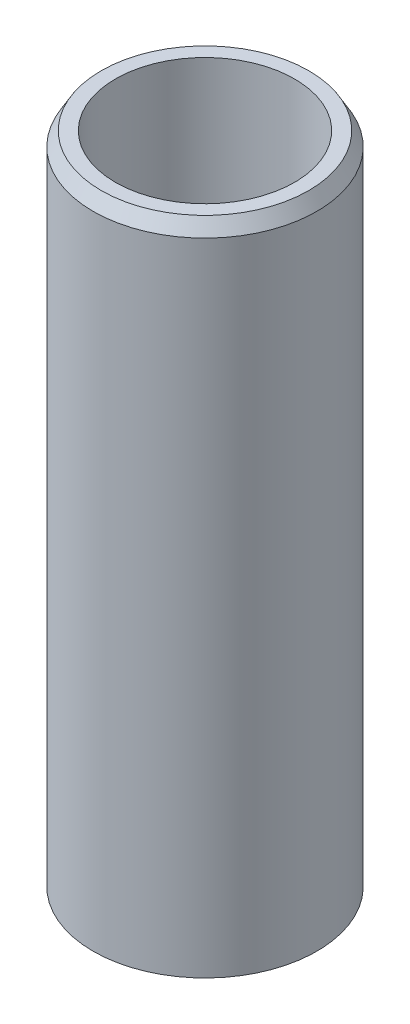
ISO-10303-21;
HEADER;
FILE_DESCRIPTION(('STEP AP214'),'2;1');
FILE_NAME('part.step','',(''),(''),'','','');
FILE_SCHEMA(('AUTOMOTIVE_DESIGN { 1 0 10303 214 1 1 1 1 }'));
ENDSEC;
DATA;
#1=APPLICATION_CONTEXT('core data for automotive mechanical design processes');
#2=APPLICATION_PROTOCOL_DEFINITION('international standard','automotive_design',2000,#1);
#3=PRODUCT_CONTEXT('',#1,'mechanical');
#4=PRODUCT('Part','Part','',(#3));
#5=PRODUCT_RELATED_PRODUCT_CATEGORY('part','',(#4));
#6=PRODUCT_DEFINITION_FORMATION('','',#4);
#7=PRODUCT_DEFINITION_CONTEXT('part definition',#1,'design');
#8=PRODUCT_DEFINITION('design','',#6,#7);
#9=PRODUCT_DEFINITION_SHAPE('','',#8);
#10=(LENGTH_UNIT() NAMED_UNIT(*) SI_UNIT(.MILLI.,.METRE.));
#11=(NAMED_UNIT(*) PLANE_ANGLE_UNIT() SI_UNIT($,.RADIAN.));
#12=(NAMED_UNIT(*) SI_UNIT($,.STERADIAN.) SOLID_ANGLE_UNIT());
#13=UNCERTAINTY_MEASURE_WITH_UNIT(LENGTH_MEASURE(1.E-05),#10,'distance_accuracy_value','');
#14=(GEOMETRIC_REPRESENTATION_CONTEXT(3) GLOBAL_UNCERTAINTY_ASSIGNED_CONTEXT((#13)) GLOBAL_UNIT_ASSIGNED_CONTEXT((#10,
#11,#12)) REPRESENTATION_CONTEXT('',''));
#15=CARTESIAN_POINT('',(0.,0.,0.));
#16=DIRECTION('',(0.,0.,1.));
#17=DIRECTION('',(1.,0.,0.));
#18=AXIS2_PLACEMENT_3D('',#15,#16,#17);
#19=CARTESIAN_POINT('',(0.,266.603887036019,0.));
#20=DIRECTION('',(0.,-1.,0.));
#21=DIRECTION('',(0.,0.,-1.));
#22=AXIS2_PLACEMENT_3D('',#19,#20,#21);
#23=CYLINDRICAL_SURFACE('',#22,45.);
#24=CARTESIAN_POINT('',(0.,260.974032538074,0.));
#25=DIRECTION('',(0.,1.,0.));
#26=DIRECTION('',(0.,0.,1.));
#27=AXIS2_PLACEMENT_3D('',#24,#25,#26);
#28=CIRCLE('',#27,45.);
#29=CARTESIAN_POINT('',(0.,260.974032538074,45.));
#30=VERTEX_POINT('',#29);
#31=EDGE_CURVE('E50',#30,#30,#28,.F.);
#32=ORIENTED_EDGE('',*,*,#31,.T.);
#33=EDGE_LOOP('',(#32));
#34=FACE_BOUND('',#33,.T.);
#35=CARTESIAN_POINT('',(0.,3.25039800988708,0.));
#36=DIRECTION('',(0.,1.,0.));
#37=DIRECTION('',(0.,0.,1.));
#38=AXIS2_PLACEMENT_3D('',#35,#36,#37);
#39=CIRCLE('',#38,45.);
#40=CARTESIAN_POINT('',(0.,3.25039800988708,45.));
#41=VERTEX_POINT('',#40);
#42=EDGE_CURVE('E51',#41,#41,#39,.T.);
#43=ORIENTED_EDGE('',*,*,#42,.T.);
#44=EDGE_LOOP('',(#43));
#45=FACE_BOUND('',#44,.T.);
#46=ADVANCED_FACE('F39',(#34,#45),#23,.T.);
#47=CARTESIAN_POINT('',(0.,266.603887036019,0.));
#48=DIRECTION('',(0.,1.,0.));
#49=DIRECTION('',(0.,0.,1.));
#50=AXIS2_PLACEMENT_3D('',#47,#48,#49);
#51=PLANE('',#50);
#52=CARTESIAN_POINT('',(0.,266.603887036019,0.));
#53=DIRECTION('',(0.,1.,0.));
#54=DIRECTION('',(0.,0.,1.));
#55=AXIS2_PLACEMENT_3D('',#52,#53,#54);
#56=CIRCLE('',#55,41.749601990113);
#57=CARTESIAN_POINT('',(0.,266.603887036019,41.749601990113));
#58=VERTEX_POINT('',#57);
#59=EDGE_CURVE('E54',#58,#58,#56,.T.);
#60=ORIENTED_EDGE('',*,*,#59,.T.);
#61=EDGE_LOOP('',(#60));
#62=FACE_BOUND('',#61,.T.);
#63=CARTESIAN_POINT('',(0.,266.603887036019,0.));
#64=DIRECTION('',(0.,1.,0.));
#65=DIRECTION('',(0.,0.,1.));
#66=AXIS2_PLACEMENT_3D('',#63,#64,#65);
#67=CIRCLE('',#66,36.0390984302873);
#68=CARTESIAN_POINT('',(0.,266.603887036019,36.0390984302873));
#69=VERTEX_POINT('',#68);
#70=EDGE_CURVE('E58',#69,#69,#67,.T.);
#71=ORIENTED_EDGE('',*,*,#70,.F.);
#72=EDGE_LOOP('',(#71));
#73=FACE_BOUND('',#72,.T.);
#74=ADVANCED_FACE('F69',(#62,#73),#51,.T.);
#75=CARTESIAN_POINT('',(0.,0.,0.));
#76=DIRECTION('',(0.,1.,0.));
#77=DIRECTION('',(0.,0.,1.));
#78=AXIS2_PLACEMENT_3D('',#75,#76,#77);
#79=PLANE('',#78);
#80=CARTESIAN_POINT('',(0.,0.,0.));
#81=DIRECTION('',(0.,1.,0.));
#82=DIRECTION('',(0.,0.,1.));
#83=AXIS2_PLACEMENT_3D('',#80,#81,#82);
#84=CIRCLE('',#83,39.3701455020548);
#85=CARTESIAN_POINT('',(0.,0.,39.3701455020548));
#86=VERTEX_POINT('',#85);
#87=EDGE_CURVE('E10',#86,#86,#84,.F.);
#88=ORIENTED_EDGE('',*,*,#87,.T.);
#89=EDGE_LOOP('',(#88));
#90=FACE_BOUND('',#89,.T.);
#91=CARTESIAN_POINT('',(0.,0.,0.));
#92=DIRECTION('',(0.,1.,0.));
#93=DIRECTION('',(0.,0.,1.));
#94=AXIS2_PLACEMENT_3D('',#91,#92,#93);
#95=CIRCLE('',#94,36.0390984302873);
#96=CARTESIAN_POINT('',(0.,0.,36.0390984302873));
#97=VERTEX_POINT('',#96);
#98=EDGE_CURVE('E63',#97,#97,#95,.T.);
#99=ORIENTED_EDGE('',*,*,#98,.T.);
#100=EDGE_LOOP('',(#99));
#101=FACE_BOUND('',#100,.T.);
#102=ADVANCED_FACE('F75',(#90,#101),#79,.F.);
#103=CARTESIAN_POINT('',(0.,266.603887036019,0.));
#104=DIRECTION('',(0.,-1.,0.));
#105=DIRECTION('',(0.,0.,-1.));
#106=AXIS2_PLACEMENT_3D('',#103,#104,#105);
#107=CYLINDRICAL_SURFACE('',#106,36.0390984302873);
#108=ORIENTED_EDGE('',*,*,#70,.T.);
#109=EDGE_LOOP('',(#108));
#110=FACE_BOUND('',#109,.T.);
#111=ORIENTED_EDGE('',*,*,#98,.F.);
#112=EDGE_LOOP('',(#111));
#113=FACE_BOUND('',#112,.T.);
#114=ADVANCED_FACE('F70',(#110,#113),#107,.F.);
#115=CARTESIAN_POINT('',(0.,266.603887036019,0.));
#116=DIRECTION('',(0.,-1.,0.));
#117=DIRECTION('',(0.,0.,-1.));
#118=AXIS2_PLACEMENT_3D('',#115,#116,#117);
#119=CONICAL_SURFACE('',#118,41.749601990113,0.523598775598292);
#120=ORIENTED_EDGE('',*,*,#31,.F.);
#121=EDGE_LOOP('',(#120));
#122=FACE_BOUND('',#121,.T.);
#123=ORIENTED_EDGE('',*,*,#59,.F.);
#124=EDGE_LOOP('',(#123));
#125=FACE_BOUND('',#124,.T.);
#126=ADVANCED_FACE('F81',(#122,#125),#119,.T.);
#127=CARTESIAN_POINT('',(0.,3.25039800988708,0.));
#128=DIRECTION('',(0.,1.,0.));
#129=DIRECTION('',(0.,0.,1.));
#130=AXIS2_PLACEMENT_3D('',#127,#128,#129);
#131=CONICAL_SURFACE('',#130,45.,1.0471975511966);
#132=ORIENTED_EDGE('',*,*,#87,.F.);
#133=EDGE_LOOP('',(#132));
#134=FACE_BOUND('',#133,.T.);
#135=ORIENTED_EDGE('',*,*,#42,.F.);
#136=EDGE_LOOP('',(#135));
#137=FACE_BOUND('',#136,.T.);
#138=ADVANCED_FACE('F45',(#134,#137),#131,.T.);
#139=CLOSED_SHELL('',(#46,#74,#102,#114,#126,#138));
#140=MANIFOLD_SOLID_BREP('B2',#139);
#141=ADVANCED_BREP_SHAPE_REPRESENTATION('',(#18,#140),#14);
#142=SHAPE_DEFINITION_REPRESENTATION(#9,#141);
ENDSEC;
END-ISO-10303-21;
